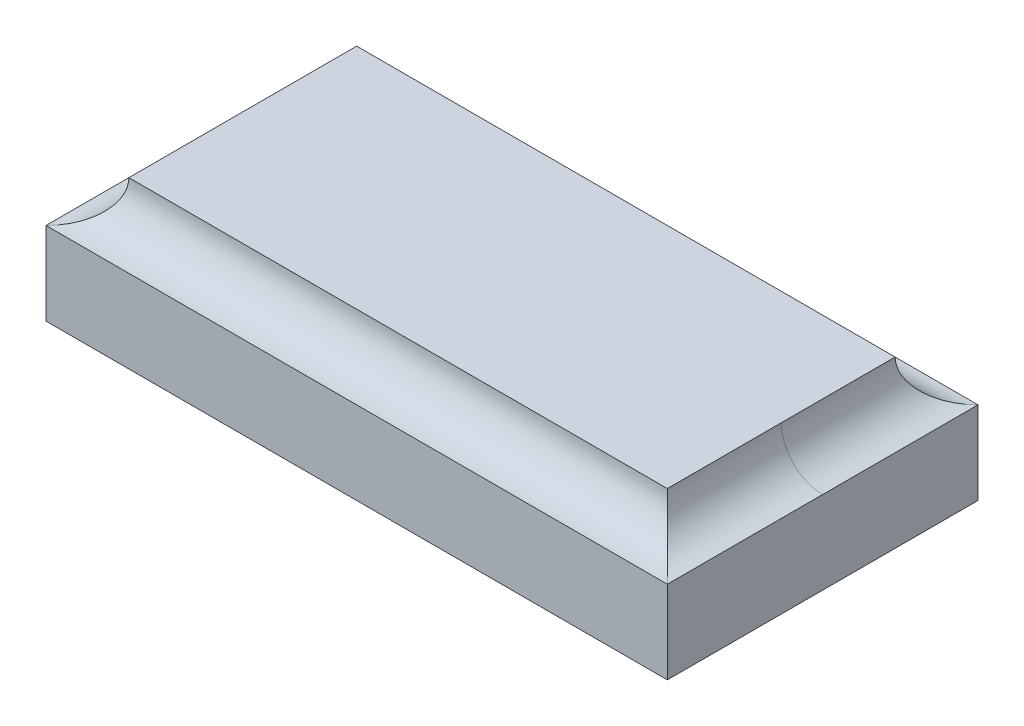
ISO-10303-21;
HEADER;
FILE_DESCRIPTION(('STEP AP214'),'2;1');
FILE_NAME('part.step','',(''),(''),'','','');
FILE_SCHEMA(('AUTOMOTIVE_DESIGN { 1 0 10303 214 1 1 1 1 }'));
ENDSEC;
DATA;
#1=APPLICATION_CONTEXT('core data for automotive mechanical design processes');
#2=APPLICATION_PROTOCOL_DEFINITION('international standard','automotive_design',2000,#1);
#3=PRODUCT_CONTEXT('',#1,'mechanical');
#4=PRODUCT('Part','Part','',(#3));
#5=PRODUCT_RELATED_PRODUCT_CATEGORY('part','',(#4));
#6=PRODUCT_DEFINITION_FORMATION('','',#4);
#7=PRODUCT_DEFINITION_CONTEXT('part definition',#1,'design');
#8=PRODUCT_DEFINITION('design','',#6,#7);
#9=PRODUCT_DEFINITION_SHAPE('','',#8);
#10=(LENGTH_UNIT() NAMED_UNIT(*) SI_UNIT(.MILLI.,.METRE.));
#11=(NAMED_UNIT(*) PLANE_ANGLE_UNIT() SI_UNIT($,.RADIAN.));
#12=(NAMED_UNIT(*) SI_UNIT($,.STERADIAN.) SOLID_ANGLE_UNIT());
#13=UNCERTAINTY_MEASURE_WITH_UNIT(LENGTH_MEASURE(1.E-05),#10,'distance_accuracy_value','');
#14=(GEOMETRIC_REPRESENTATION_CONTEXT(3) GLOBAL_UNCERTAINTY_ASSIGNED_CONTEXT((#13)) GLOBAL_UNIT_ASSIGNED_CONTEXT((#10,
#11,#12)) REPRESENTATION_CONTEXT('',''));
#15=CARTESIAN_POINT('',(0.,0.,0.));
#16=DIRECTION('',(0.,0.,1.));
#17=DIRECTION('',(1.,0.,0.));
#18=AXIS2_PLACEMENT_3D('',#15,#16,#17);
#19=CARTESIAN_POINT('',(150.,60.,-75.));
#20=DIRECTION('',(0.,0.,1.));
#21=DIRECTION('',(1.,0.,0.));
#22=AXIS2_PLACEMENT_3D('',#19,#20,#21);
#23=PLANE('',#22);
#24=DIRECTION('',(-1.,0.,0.));
#25=VECTOR('',#24,1.);
#26=CARTESIAN_POINT('',(172.1,40.,-75.));
#27=LINE('',#26,#25);
#28=CARTESIAN_POINT('',(150.,40.,-75.));
#29=VERTEX_POINT('',#28);
#30=CARTESIAN_POINT('',(-150.,40.,-75.));
#31=VERTEX_POINT('',#30);
#32=EDGE_CURVE('E138',#29,#31,#27,.T.);
#33=ORIENTED_EDGE('',*,*,#32,.F.);
#34=DIRECTION('',(0.,-1.,0.));
#35=VECTOR('',#34,1.);
#36=CARTESIAN_POINT('',(150.,60.,-75.));
#37=LINE('',#36,#35);
#38=CARTESIAN_POINT('',(150.,0.,-75.));
#39=VERTEX_POINT('',#38);
#40=EDGE_CURVE('E115',#29,#39,#37,.T.);
#41=ORIENTED_EDGE('',*,*,#40,.T.);
#42=DIRECTION('',(-1.,0.,0.));
#43=VECTOR('',#42,1.);
#44=CARTESIAN_POINT('',(150.,0.,-75.));
#45=LINE('',#44,#43);
#46=CARTESIAN_POINT('',(-150.,0.,-75.));
#47=VERTEX_POINT('',#46);
#48=EDGE_CURVE('E119',#39,#47,#45,.T.);
#49=ORIENTED_EDGE('',*,*,#48,.T.);
#50=DIRECTION('',(0.,-1.,0.));
#51=VECTOR('',#50,1.);
#52=CARTESIAN_POINT('',(-150.,60.,-75.));
#53=LINE('',#52,#51);
#54=EDGE_CURVE('E117',#31,#47,#53,.T.);
#55=ORIENTED_EDGE('',*,*,#54,.F.);
#56=EDGE_LOOP('',(#33,#41,#49,#55));
#57=FACE_BOUND('',#56,.T.);
#58=ADVANCED_FACE('F33',(#57),#23,.F.);
#59=CARTESIAN_POINT('',(-150.,60.,-75.));
#60=DIRECTION('',(1.,0.,0.));
#61=DIRECTION('',(0.,0.,-1.));
#62=AXIS2_PLACEMENT_3D('',#59,#60,#61);
#63=PLANE('',#62);
#64=DIRECTION('',(0.,0.,1.));
#65=VECTOR('',#64,1.);
#66=CARTESIAN_POINT('',(-150.,40.,-97.1));
#67=LINE('',#66,#65);
#68=CARTESIAN_POINT('',(-150.,40.,75.));
#69=VERTEX_POINT('',#68);
#70=EDGE_CURVE('E136',#31,#69,#67,.T.);
#71=ORIENTED_EDGE('',*,*,#70,.F.);
#72=ORIENTED_EDGE('',*,*,#54,.T.);
#73=DIRECTION('',(0.,0.,1.));
#74=VECTOR('',#73,1.);
#75=CARTESIAN_POINT('',(-150.,0.,-75.));
#76=LINE('',#75,#74);
#77=CARTESIAN_POINT('',(-150.,0.,75.));
#78=VERTEX_POINT('',#77);
#79=EDGE_CURVE('E128',#47,#78,#76,.T.);
#80=ORIENTED_EDGE('',*,*,#79,.T.);
#81=DIRECTION('',(0.,-1.,0.));
#82=VECTOR('',#81,1.);
#83=CARTESIAN_POINT('',(-150.,60.,75.));
#84=LINE('',#83,#82);
#85=EDGE_CURVE('E94',#69,#78,#84,.T.);
#86=ORIENTED_EDGE('',*,*,#85,.F.);
#87=EDGE_LOOP('',(#71,#72,#80,#86));
#88=FACE_BOUND('',#87,.T.);
#89=ADVANCED_FACE('F35',(#88),#63,.F.);
#90=CARTESIAN_POINT('',(150.,60.,75.));
#91=DIRECTION('',(0.,0.,-1.));
#92=DIRECTION('',(-1.,0.,0.));
#93=AXIS2_PLACEMENT_3D('',#90,#91,#92);
#94=PLANE('',#93);
#95=DIRECTION('',(1.,0.,0.));
#96=VECTOR('',#95,1.);
#97=CARTESIAN_POINT('',(-172.1,40.,75.));
#98=LINE('',#97,#96);
#99=CARTESIAN_POINT('',(150.,40.,75.));
#100=VERTEX_POINT('',#99);
#101=EDGE_CURVE('E131',#69,#100,#98,.T.);
#102=ORIENTED_EDGE('',*,*,#101,.F.);
#103=ORIENTED_EDGE('',*,*,#85,.T.);
#104=DIRECTION('',(1.,0.,0.));
#105=VECTOR('',#104,1.);
#106=CARTESIAN_POINT('',(150.,0.,75.));
#107=LINE('',#106,#105);
#108=CARTESIAN_POINT('',(150.,0.,75.));
#109=VERTEX_POINT('',#108);
#110=EDGE_CURVE('E125',#78,#109,#107,.T.);
#111=ORIENTED_EDGE('',*,*,#110,.T.);
#112=DIRECTION('',(0.,-1.,0.));
#113=VECTOR('',#112,1.);
#114=CARTESIAN_POINT('',(150.,60.,75.));
#115=LINE('',#114,#113);
#116=EDGE_CURVE('E113',#100,#109,#115,.T.);
#117=ORIENTED_EDGE('',*,*,#116,.F.);
#118=EDGE_LOOP('',(#102,#103,#111,#117));
#119=FACE_BOUND('',#118,.T.);
#120=ADVANCED_FACE('F163',(#119),#94,.F.);
#121=CARTESIAN_POINT('',(150.,60.,-75.));
#122=DIRECTION('',(-1.,0.,0.));
#123=DIRECTION('',(0.,0.,1.));
#124=AXIS2_PLACEMENT_3D('',#121,#122,#123);
#125=PLANE('',#124);
#126=DIRECTION('',(0.,0.,-1.));
#127=VECTOR('',#126,1.);
#128=CARTESIAN_POINT('',(150.,40.,97.1));
#129=LINE('',#128,#127);
#130=CARTESIAN_POINT('',(150.,40.,0.));
#131=VERTEX_POINT('',#130);
#132=EDGE_CURVE('E133',#100,#131,#129,.T.);
#133=ORIENTED_EDGE('',*,*,#132,.F.);
#134=ORIENTED_EDGE('',*,*,#116,.T.);
#135=DIRECTION('',(0.,0.,-1.));
#136=VECTOR('',#135,1.);
#137=CARTESIAN_POINT('',(150.,0.,-75.));
#138=LINE('',#137,#136);
#139=EDGE_CURVE('E122',#109,#39,#138,.T.);
#140=ORIENTED_EDGE('',*,*,#139,.T.);
#141=ORIENTED_EDGE('',*,*,#40,.F.);
#142=DIRECTION('',(0.,0.,-1.));
#143=VECTOR('',#142,1.);
#144=CARTESIAN_POINT('',(150.,40.,0.));
#145=LINE('',#144,#143);
#146=EDGE_CURVE('E102',#131,#29,#145,.T.);
#147=ORIENTED_EDGE('',*,*,#146,.F.);
#148=EDGE_LOOP('',(#133,#134,#140,#141,#147));
#149=FACE_BOUND('',#148,.T.);
#150=ADVANCED_FACE('F160',(#149),#125,.F.);
#151=CARTESIAN_POINT('',(0.,0.,0.));
#152=DIRECTION('',(0.,-1.,0.));
#153=DIRECTION('',(0.,0.,-1.));
#154=AXIS2_PLACEMENT_3D('',#151,#152,#153);
#155=PLANE('',#154);
#156=ORIENTED_EDGE('',*,*,#79,.F.);
#157=ORIENTED_EDGE('',*,*,#48,.F.);
#158=ORIENTED_EDGE('',*,*,#139,.F.);
#159=ORIENTED_EDGE('',*,*,#110,.F.);
#160=EDGE_LOOP('',(#156,#157,#158,#159));
#161=FACE_BOUND('',#160,.T.);
#162=ADVANCED_FACE('F170',(#161),#155,.T.);
#163=CARTESIAN_POINT('',(-172.1,60.,75.));
#164=DIRECTION('',(1.,0.,0.));
#165=DIRECTION('',(0.,0.,-1.));
#166=AXIS2_PLACEMENT_3D('',#163,#164,#165);
#167=CYLINDRICAL_SURFACE('',#166,20.);
#168=ORIENTED_EDGE('',*,*,#101,.T.);
#169=CARTESIAN_POINT('',(150.,60.,75.));
#170=DIRECTION('',(0.707106781186547,0.,-0.707106781186548));
#171=DIRECTION('',(-0.707106781186548,0.,-0.707106781186547));
#172=AXIS2_PLACEMENT_3D('',#169,#170,#171);
#173=ELLIPSE('',#172,28.2842712474619,20.);
#174=CARTESIAN_POINT('',(130.,60.,55.));
#175=VERTEX_POINT('',#174);
#176=EDGE_CURVE('E142',#100,#175,#173,.T.);
#177=ORIENTED_EDGE('',*,*,#176,.T.);
#178=DIRECTION('',(1.,0.,0.));
#179=VECTOR('',#178,1.);
#180=CARTESIAN_POINT('',(-172.1,60.,55.));
#181=LINE('',#180,#179);
#182=CARTESIAN_POINT('',(-130.,60.,55.));
#183=VERTEX_POINT('',#182);
#184=EDGE_CURVE('E11',#175,#183,#181,.F.);
#185=ORIENTED_EDGE('',*,*,#184,.T.);
#186=CARTESIAN_POINT('',(-150.,60.,75.));
#187=DIRECTION('',(0.707106781186548,0.,0.707106781186547));
#188=DIRECTION('',(-0.707106781186547,0.,0.707106781186548));
#189=AXIS2_PLACEMENT_3D('',#186,#187,#188);
#190=ELLIPSE('',#189,28.2842712474619,20.);
#191=EDGE_CURVE('E104',#69,#183,#190,.T.);
#192=ORIENTED_EDGE('',*,*,#191,.F.);
#193=EDGE_LOOP('',(#168,#177,#185,#192));
#194=FACE_BOUND('',#193,.T.);
#195=ADVANCED_FACE('F153',(#194),#167,.F.);
#196=CARTESIAN_POINT('',(150.,60.,97.1));
#197=DIRECTION('',(0.,0.,-1.));
#198=DIRECTION('',(-1.,0.,0.));
#199=AXIS2_PLACEMENT_3D('',#196,#197,#198);
#200=CYLINDRICAL_SURFACE('',#199,20.);
#201=ORIENTED_EDGE('',*,*,#132,.T.);
#202=CARTESIAN_POINT('',(150.,60.,0.));
#203=DIRECTION('',(0.,0.,1.));
#204=DIRECTION('',(1.,0.,0.));
#205=AXIS2_PLACEMENT_3D('',#202,#203,#204);
#206=CIRCLE('',#205,20.);
#207=CARTESIAN_POINT('',(130.,60.,0.));
#208=VERTEX_POINT('',#207);
#209=EDGE_CURVE('E140',#208,#131,#206,.T.);
#210=ORIENTED_EDGE('',*,*,#209,.F.);
#211=DIRECTION('',(0.,0.,-1.));
#212=VECTOR('',#211,1.);
#213=CARTESIAN_POINT('',(130.,60.,97.1000000000001));
#214=LINE('',#213,#212);
#215=EDGE_CURVE('E41',#208,#175,#214,.F.);
#216=ORIENTED_EDGE('',*,*,#215,.T.);
#217=ORIENTED_EDGE('',*,*,#176,.F.);
#218=EDGE_LOOP('',(#201,#210,#216,#217));
#219=FACE_BOUND('',#218,.T.);
#220=ADVANCED_FACE('F157',(#219),#200,.F.);
#221=CARTESIAN_POINT('',(150.,60.,0.));
#222=DIRECTION('',(0.,0.,-1.));
#223=DIRECTION('',(-1.,0.,0.));
#224=AXIS2_PLACEMENT_3D('',#221,#222,#223);
#225=CYLINDRICAL_SURFACE('',#224,20.);
#226=ORIENTED_EDGE('',*,*,#146,.T.);
#227=CARTESIAN_POINT('',(150.,60.,-75.));
#228=DIRECTION('',(-0.707106781186548,0.,-0.707106781186547));
#229=DIRECTION('',(-0.707106781186547,0.,0.707106781186548));
#230=AXIS2_PLACEMENT_3D('',#227,#228,#229);
#231=ELLIPSE('',#230,28.2842712474619,20.);
#232=CARTESIAN_POINT('',(130.,60.,-54.9999999999999));
#233=VERTEX_POINT('',#232);
#234=EDGE_CURVE('E48',#29,#233,#231,.T.);
#235=ORIENTED_EDGE('',*,*,#234,.T.);
#236=DIRECTION('',(0.,0.,-1.));
#237=VECTOR('',#236,1.);
#238=CARTESIAN_POINT('',(130.,60.,0.));
#239=LINE('',#238,#237);
#240=EDGE_CURVE('E99',#233,#208,#239,.F.);
#241=ORIENTED_EDGE('',*,*,#240,.T.);
#242=ORIENTED_EDGE('',*,*,#209,.T.);
#243=EDGE_LOOP('',(#226,#235,#241,#242));
#244=FACE_BOUND('',#243,.T.);
#245=ADVANCED_FACE('F97',(#244),#225,.F.);
#246=CARTESIAN_POINT('',(-150.,60.,-97.1));
#247=DIRECTION('',(0.,0.,1.));
#248=DIRECTION('',(1.,0.,0.));
#249=AXIS2_PLACEMENT_3D('',#246,#247,#248);
#250=CYLINDRICAL_SURFACE('',#249,20.);
#251=ORIENTED_EDGE('',*,*,#70,.T.);
#252=ORIENTED_EDGE('',*,*,#191,.T.);
#253=DIRECTION('',(0.,0.,1.));
#254=VECTOR('',#253,1.);
#255=CARTESIAN_POINT('',(-130.,60.,-97.1));
#256=LINE('',#255,#254);
#257=CARTESIAN_POINT('',(-130.,60.,-54.9999999999999));
#258=VERTEX_POINT('',#257);
#259=EDGE_CURVE('E93',#183,#258,#256,.F.);
#260=ORIENTED_EDGE('',*,*,#259,.T.);
#261=CARTESIAN_POINT('',(-150.,60.,-74.9999999999999));
#262=DIRECTION('',(-0.707106781186547,0.,0.707106781186548));
#263=DIRECTION('',(-0.707106781186548,0.,-0.707106781186547));
#264=AXIS2_PLACEMENT_3D('',#261,#262,#263);
#265=ELLIPSE('',#264,28.2842712474619,20.);
#266=EDGE_CURVE('E53',#31,#258,#265,.T.);
#267=ORIENTED_EDGE('',*,*,#266,.F.);
#268=EDGE_LOOP('',(#251,#252,#260,#267));
#269=FACE_BOUND('',#268,.T.);
#270=ADVANCED_FACE('F149',(#269),#250,.F.);
#271=CARTESIAN_POINT('',(172.1,60.,-75.));
#272=DIRECTION('',(-1.,0.,0.));
#273=DIRECTION('',(0.,0.,1.));
#274=AXIS2_PLACEMENT_3D('',#271,#272,#273);
#275=CYLINDRICAL_SURFACE('',#274,20.);
#276=ORIENTED_EDGE('',*,*,#32,.T.);
#277=ORIENTED_EDGE('',*,*,#266,.T.);
#278=DIRECTION('',(-1.,0.,0.));
#279=VECTOR('',#278,1.);
#280=CARTESIAN_POINT('',(172.1,60.,-54.9999999999999));
#281=LINE('',#280,#279);
#282=EDGE_CURVE('E88',#258,#233,#281,.F.);
#283=ORIENTED_EDGE('',*,*,#282,.T.);
#284=ORIENTED_EDGE('',*,*,#234,.F.);
#285=EDGE_LOOP('',(#276,#277,#283,#284));
#286=FACE_BOUND('',#285,.T.);
#287=ADVANCED_FACE('F89',(#286),#275,.F.);
#288=CARTESIAN_POINT('',(0.,60.,0.));
#289=DIRECTION('',(0.,-1.,0.));
#290=DIRECTION('',(0.,0.,-1.));
#291=AXIS2_PLACEMENT_3D('',#288,#289,#290);
#292=PLANE('',#291);
#293=ORIENTED_EDGE('',*,*,#184,.F.);
#294=ORIENTED_EDGE('',*,*,#215,.F.);
#295=ORIENTED_EDGE('',*,*,#240,.F.);
#296=ORIENTED_EDGE('',*,*,#282,.F.);
#297=ORIENTED_EDGE('',*,*,#259,.F.);
#298=EDGE_LOOP('',(#293,#294,#295,#296,#297));
#299=FACE_BOUND('',#298,.T.);
#300=ADVANCED_FACE('F108',(#299),#292,.F.);
#301=CLOSED_SHELL('',(#58,#89,#120,#150,#162,#195,#220,#245,#270,#287,#300));
#302=MANIFOLD_SOLID_BREP('B2',#301);
#303=ADVANCED_BREP_SHAPE_REPRESENTATION('',(#18,#302),#14);
#304=SHAPE_DEFINITION_REPRESENTATION(#9,#303);
ENDSEC;
END-ISO-10303-21;
